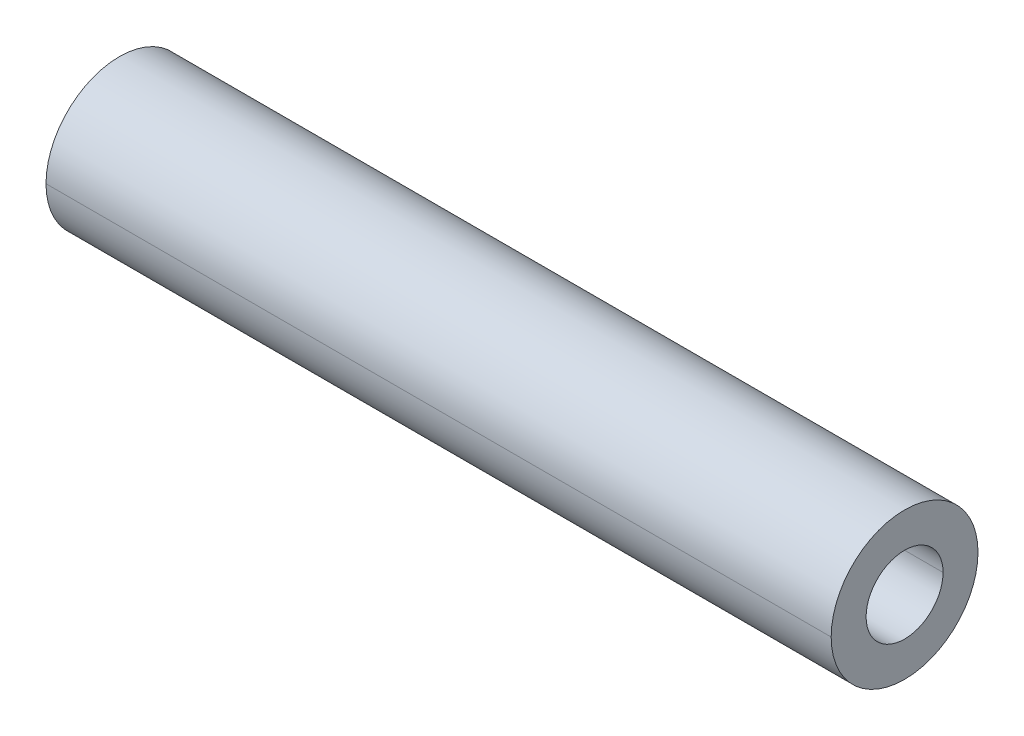
ISO-10303-21;
HEADER;
FILE_DESCRIPTION(('STEP AP214'),'2;1');
FILE_NAME('part.step','',(''),(''),'','','');
FILE_SCHEMA(('AUTOMOTIVE_DESIGN { 1 0 10303 214 1 1 1 1 }'));
ENDSEC;
DATA;
#1=APPLICATION_CONTEXT('core data for automotive mechanical design processes');
#2=APPLICATION_PROTOCOL_DEFINITION('international standard','automotive_design',2000,#1);
#3=PRODUCT_CONTEXT('',#1,'mechanical');
#4=PRODUCT('Part','Part','',(#3));
#5=PRODUCT_RELATED_PRODUCT_CATEGORY('part','',(#4));
#6=PRODUCT_DEFINITION_FORMATION('','',#4);
#7=PRODUCT_DEFINITION_CONTEXT('part definition',#1,'design');
#8=PRODUCT_DEFINITION('design','',#6,#7);
#9=PRODUCT_DEFINITION_SHAPE('','',#8);
#10=(LENGTH_UNIT() NAMED_UNIT(*) SI_UNIT(.MILLI.,.METRE.));
#11=(NAMED_UNIT(*) PLANE_ANGLE_UNIT() SI_UNIT($,.RADIAN.));
#12=(NAMED_UNIT(*) SI_UNIT($,.STERADIAN.) SOLID_ANGLE_UNIT());
#13=UNCERTAINTY_MEASURE_WITH_UNIT(LENGTH_MEASURE(1.E-05),#10,'distance_accuracy_value','');
#14=(GEOMETRIC_REPRESENTATION_CONTEXT(3) GLOBAL_UNCERTAINTY_ASSIGNED_CONTEXT((#13)) GLOBAL_UNIT_ASSIGNED_CONTEXT((#10,
#11,#12)) REPRESENTATION_CONTEXT('',''));
#15=CARTESIAN_POINT('',(0.,0.,0.));
#16=DIRECTION('',(0.,0.,1.));
#17=DIRECTION('',(1.,0.,0.));
#18=AXIS2_PLACEMENT_3D('',#15,#16,#17);
#19=CARTESIAN_POINT('',(25.4,0.,0.));
#20=DIRECTION('',(-1.,0.,0.));
#21=DIRECTION('',(0.,0.,1.));
#22=AXIS2_PLACEMENT_3D('',#19,#20,#21);
#23=CYLINDRICAL_SURFACE('',#22,2.4892);
#24=DIRECTION('',(-1.,0.,0.));
#25=VECTOR('',#24,1.);
#26=CARTESIAN_POINT('',(25.4,0.,-2.4892));
#27=LINE('',#26,#25);
#28=CARTESIAN_POINT('',(25.4,0.,-2.4892));
#29=VERTEX_POINT('',#28);
#30=CARTESIAN_POINT('',(-25.4,0.,-2.4892));
#31=VERTEX_POINT('',#30);
#32=EDGE_CURVE('E66',#29,#31,#27,.T.);
#33=ORIENTED_EDGE('',*,*,#32,.F.);
#34=CARTESIAN_POINT('',(25.4,0.,0.));
#35=DIRECTION('',(1.,0.,0.));
#36=DIRECTION('',(0.,0.,-1.));
#37=AXIS2_PLACEMENT_3D('',#34,#35,#36);
#38=CIRCLE('',#37,2.4892);
#39=CARTESIAN_POINT('',(25.4,0.,2.4892));
#40=VERTEX_POINT('',#39);
#41=EDGE_CURVE('E95',#29,#40,#38,.T.);
#42=ORIENTED_EDGE('',*,*,#41,.T.);
#43=DIRECTION('',(-1.,0.,0.));
#44=VECTOR('',#43,1.);
#45=CARTESIAN_POINT('',(25.4,0.,2.4892));
#46=LINE('',#45,#44);
#47=CARTESIAN_POINT('',(-25.4,0.,2.4892));
#48=VERTEX_POINT('',#47);
#49=EDGE_CURVE('E69',#40,#48,#46,.T.);
#50=ORIENTED_EDGE('',*,*,#49,.T.);
#51=CARTESIAN_POINT('',(-25.4,0.,0.));
#52=DIRECTION('',(1.,0.,0.));
#53=DIRECTION('',(0.,0.,-1.));
#54=AXIS2_PLACEMENT_3D('',#51,#52,#53);
#55=CIRCLE('',#54,2.4892);
#56=EDGE_CURVE('E11',#31,#48,#55,.T.);
#57=ORIENTED_EDGE('',*,*,#56,.F.);
#58=EDGE_LOOP('',(#33,#42,#50,#57));
#59=FACE_BOUND('',#58,.T.);
#60=ADVANCED_FACE('F16',(#59),#23,.F.);
#61=CARTESIAN_POINT('',(25.4,0.,0.));
#62=DIRECTION('',(-1.,0.,0.));
#63=DIRECTION('',(0.,0.,1.));
#64=AXIS2_PLACEMENT_3D('',#61,#62,#63);
#65=CYLINDRICAL_SURFACE('',#64,4.7498);
#66=DIRECTION('',(-1.,0.,0.));
#67=VECTOR('',#66,1.);
#68=CARTESIAN_POINT('',(25.4,0.,-4.7498));
#69=LINE('',#68,#67);
#70=CARTESIAN_POINT('',(25.4,0.,-4.7498));
#71=VERTEX_POINT('',#70);
#72=CARTESIAN_POINT('',(-25.4,0.,-4.7498));
#73=VERTEX_POINT('',#72);
#74=EDGE_CURVE('E88',#71,#73,#69,.T.);
#75=ORIENTED_EDGE('',*,*,#74,.F.);
#76=CARTESIAN_POINT('',(25.4,0.,0.));
#77=DIRECTION('',(1.,0.,0.));
#78=DIRECTION('',(0.,0.,-1.));
#79=AXIS2_PLACEMENT_3D('',#76,#77,#78);
#80=CIRCLE('',#79,4.7498);
#81=CARTESIAN_POINT('',(25.4,0.,4.7498));
#82=VERTEX_POINT('',#81);
#83=EDGE_CURVE('E98',#82,#71,#80,.T.);
#84=ORIENTED_EDGE('',*,*,#83,.F.);
#85=DIRECTION('',(-1.,0.,0.));
#86=VECTOR('',#85,1.);
#87=CARTESIAN_POINT('',(25.4,0.,4.7498));
#88=LINE('',#87,#86);
#89=CARTESIAN_POINT('',(-25.4,0.,4.7498));
#90=VERTEX_POINT('',#89);
#91=EDGE_CURVE('E103',#82,#90,#88,.T.);
#92=ORIENTED_EDGE('',*,*,#91,.T.);
#93=CARTESIAN_POINT('',(-25.4,0.,0.));
#94=DIRECTION('',(1.,0.,0.));
#95=DIRECTION('',(0.,0.,-1.));
#96=AXIS2_PLACEMENT_3D('',#93,#94,#95);
#97=CIRCLE('',#96,4.7498);
#98=EDGE_CURVE('E27',#90,#73,#97,.T.);
#99=ORIENTED_EDGE('',*,*,#98,.T.);
#100=EDGE_LOOP('',(#75,#84,#92,#99));
#101=FACE_BOUND('',#100,.T.);
#102=ADVANCED_FACE('F122',(#101),#65,.T.);
#103=CARTESIAN_POINT('',(-25.4,0.,0.));
#104=DIRECTION('',(1.,0.,0.));
#105=DIRECTION('',(0.,1.,0.));
#106=AXIS2_PLACEMENT_3D('',#103,#104,#105);
#107=PLANE('',#106);
#108=CARTESIAN_POINT('',(-25.4,0.,0.));
#109=DIRECTION('',(1.,0.,0.));
#110=DIRECTION('',(0.,0.,-1.));
#111=AXIS2_PLACEMENT_3D('',#108,#109,#110);
#112=CIRCLE('',#111,2.4892);
#113=EDGE_CURVE('E72',#48,#31,#112,.T.);
#114=ORIENTED_EDGE('',*,*,#113,.T.);
#115=ORIENTED_EDGE('',*,*,#56,.T.);
#116=EDGE_LOOP('',(#114,#115));
#117=FACE_BOUND('',#116,.T.);
#118=ORIENTED_EDGE('',*,*,#98,.F.);
#119=CARTESIAN_POINT('',(-25.4,0.,0.));
#120=DIRECTION('',(1.,0.,0.));
#121=DIRECTION('',(0.,0.,-1.));
#122=AXIS2_PLACEMENT_3D('',#119,#120,#121);
#123=CIRCLE('',#122,4.7498);
#124=EDGE_CURVE('E20',#73,#90,#123,.T.);
#125=ORIENTED_EDGE('',*,*,#124,.F.);
#126=EDGE_LOOP('',(#118,#125));
#127=FACE_BOUND('',#126,.T.);
#128=ADVANCED_FACE('F73',(#117,#127),#107,.F.);
#129=CARTESIAN_POINT('',(25.4,0.,0.));
#130=DIRECTION('',(1.,0.,0.));
#131=DIRECTION('',(0.,1.,0.));
#132=AXIS2_PLACEMENT_3D('',#129,#130,#131);
#133=PLANE('',#132);
#134=CARTESIAN_POINT('',(25.4,0.,0.));
#135=DIRECTION('',(1.,0.,0.));
#136=DIRECTION('',(0.,0.,-1.));
#137=AXIS2_PLACEMENT_3D('',#134,#135,#136);
#138=CIRCLE('',#137,2.4892);
#139=EDGE_CURVE('E78',#40,#29,#138,.T.);
#140=ORIENTED_EDGE('',*,*,#139,.F.);
#141=ORIENTED_EDGE('',*,*,#41,.F.);
#142=EDGE_LOOP('',(#140,#141));
#143=FACE_BOUND('',#142,.T.);
#144=ORIENTED_EDGE('',*,*,#83,.T.);
#145=CARTESIAN_POINT('',(25.4,0.,0.));
#146=DIRECTION('',(1.,0.,0.));
#147=DIRECTION('',(0.,0.,-1.));
#148=AXIS2_PLACEMENT_3D('',#145,#146,#147);
#149=CIRCLE('',#148,4.7498);
#150=EDGE_CURVE('E92',#71,#82,#149,.T.);
#151=ORIENTED_EDGE('',*,*,#150,.T.);
#152=EDGE_LOOP('',(#144,#151));
#153=FACE_BOUND('',#152,.T.);
#154=ADVANCED_FACE('F121',(#143,#153),#133,.T.);
#155=CARTESIAN_POINT('',(25.4,0.,0.));
#156=DIRECTION('',(-1.,0.,0.));
#157=DIRECTION('',(0.,0.,1.));
#158=AXIS2_PLACEMENT_3D('',#155,#156,#157);
#159=CYLINDRICAL_SURFACE('',#158,4.7498);
#160=ORIENTED_EDGE('',*,*,#150,.F.);
#161=ORIENTED_EDGE('',*,*,#74,.T.);
#162=ORIENTED_EDGE('',*,*,#124,.T.);
#163=ORIENTED_EDGE('',*,*,#91,.F.);
#164=EDGE_LOOP('',(#160,#161,#162,#163));
#165=FACE_BOUND('',#164,.T.);
#166=ADVANCED_FACE('F118',(#165),#159,.T.);
#167=CARTESIAN_POINT('',(25.4,0.,0.));
#168=DIRECTION('',(-1.,0.,0.));
#169=DIRECTION('',(0.,0.,1.));
#170=AXIS2_PLACEMENT_3D('',#167,#168,#169);
#171=CYLINDRICAL_SURFACE('',#170,2.4892);
#172=ORIENTED_EDGE('',*,*,#139,.T.);
#173=ORIENTED_EDGE('',*,*,#32,.T.);
#174=ORIENTED_EDGE('',*,*,#113,.F.);
#175=ORIENTED_EDGE('',*,*,#49,.F.);
#176=EDGE_LOOP('',(#172,#173,#174,#175));
#177=FACE_BOUND('',#176,.T.);
#178=ADVANCED_FACE('F18',(#177),#171,.F.);
#179=CLOSED_SHELL('',(#60,#102,#128,#154,#166,#178));
#180=MANIFOLD_SOLID_BREP('B1',#179);
#181=ADVANCED_BREP_SHAPE_REPRESENTATION('',(#18,#180),#14);
#182=SHAPE_DEFINITION_REPRESENTATION(#9,#181);
ENDSEC;
END-ISO-10303-21;
